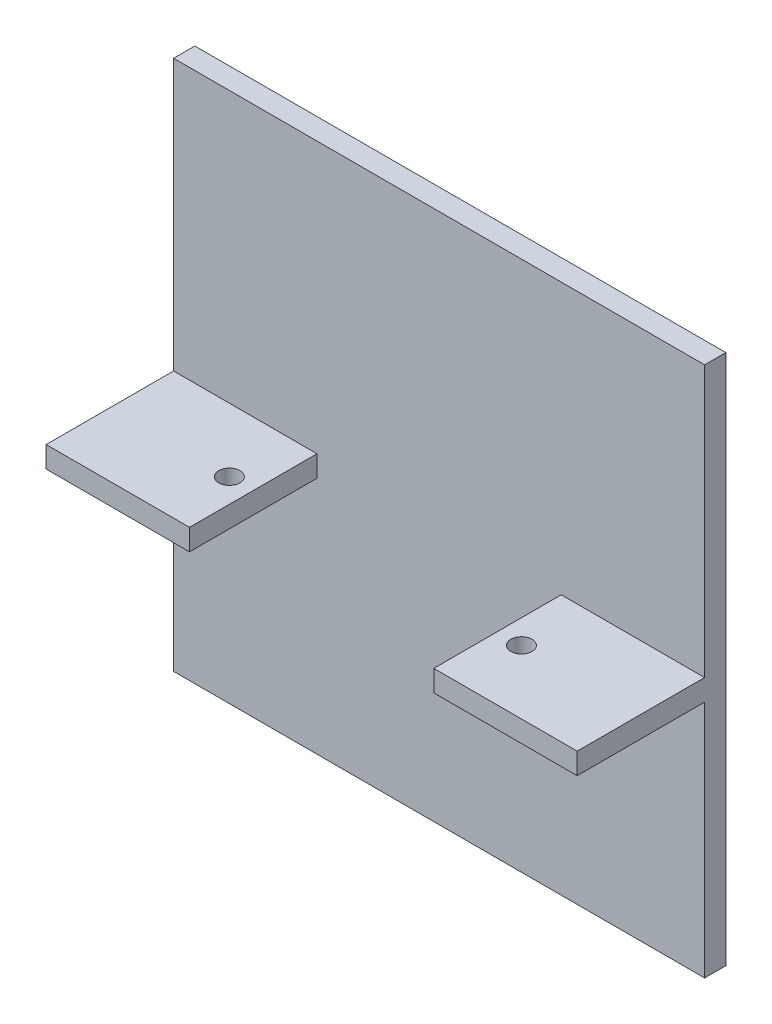
ISO-10303-21;
HEADER;
FILE_DESCRIPTION(('STEP AP214'),'2;1');
FILE_NAME('part.step','',(''),(''),'','','');
FILE_SCHEMA(('AUTOMOTIVE_DESIGN { 1 0 10303 214 1 1 1 1 }'));
ENDSEC;
DATA;
#1=APPLICATION_CONTEXT('core data for automotive mechanical design processes');
#2=APPLICATION_PROTOCOL_DEFINITION('international standard','automotive_design',2000,#1);
#3=PRODUCT_CONTEXT('',#1,'mechanical');
#4=PRODUCT('Part','Part','',(#3));
#5=PRODUCT_RELATED_PRODUCT_CATEGORY('part','',(#4));
#6=PRODUCT_DEFINITION_FORMATION('','',#4);
#7=PRODUCT_DEFINITION_CONTEXT('part definition',#1,'design');
#8=PRODUCT_DEFINITION('design','',#6,#7);
#9=PRODUCT_DEFINITION_SHAPE('','',#8);
#10=(LENGTH_UNIT() NAMED_UNIT(*) SI_UNIT(.MILLI.,.METRE.));
#11=(NAMED_UNIT(*) PLANE_ANGLE_UNIT() SI_UNIT($,.RADIAN.));
#12=(NAMED_UNIT(*) SI_UNIT($,.STERADIAN.) SOLID_ANGLE_UNIT());
#13=UNCERTAINTY_MEASURE_WITH_UNIT(LENGTH_MEASURE(1.E-05),#10,'distance_accuracy_value','');
#14=(GEOMETRIC_REPRESENTATION_CONTEXT(3) GLOBAL_UNCERTAINTY_ASSIGNED_CONTEXT((#13)) GLOBAL_UNIT_ASSIGNED_CONTEXT((#10,
#11,#12)) REPRESENTATION_CONTEXT('',''));
#15=CARTESIAN_POINT('',(0.,0.,0.));
#16=DIRECTION('',(0.,0.,1.));
#17=DIRECTION('',(1.,0.,0.));
#18=AXIS2_PLACEMENT_3D('',#15,#16,#17);
#19=CARTESIAN_POINT('',(25.,25.,2.));
#20=DIRECTION('',(-1.,0.,0.));
#21=DIRECTION('',(0.,-1.,0.));
#22=AXIS2_PLACEMENT_3D('',#19,#20,#21);
#23=PLANE('',#22);
#24=DIRECTION('',(0.,1.,0.));
#25=VECTOR('',#24,1.);
#26=CARTESIAN_POINT('',(25.,25.,0.));
#27=LINE('',#26,#25);
#28=CARTESIAN_POINT('',(25.,-25.,0.));
#29=VERTEX_POINT('',#28);
#30=CARTESIAN_POINT('',(25.,25.,0.));
#31=VERTEX_POINT('',#30);
#32=EDGE_CURVE('E196',#29,#31,#27,.T.);
#33=ORIENTED_EDGE('',*,*,#32,.T.);
#34=DIRECTION('',(0.,0.,-1.));
#35=VECTOR('',#34,1.);
#36=CARTESIAN_POINT('',(25.,25.,2.));
#37=LINE('',#36,#35);
#38=CARTESIAN_POINT('',(25.,25.,2.));
#39=VERTEX_POINT('',#38);
#40=EDGE_CURVE('E11',#39,#31,#37,.T.);
#41=ORIENTED_EDGE('',*,*,#40,.F.);
#42=DIRECTION('',(0.,1.,0.));
#43=VECTOR('',#42,1.);
#44=CARTESIAN_POINT('',(25.,25.,2.));
#45=LINE('',#44,#43);
#46=CARTESIAN_POINT('',(25.,-0.499999999999995,2.));
#47=VERTEX_POINT('',#46);
#48=EDGE_CURVE('E147',#47,#39,#45,.T.);
#49=ORIENTED_EDGE('',*,*,#48,.F.);
#50=DIRECTION('',(0.,0.,-1.));
#51=VECTOR('',#50,1.);
#52=CARTESIAN_POINT('',(25.,-0.499999999999995,2.));
#53=LINE('',#52,#51);
#54=CARTESIAN_POINT('',(25.,-0.499999999999995,14.));
#55=VERTEX_POINT('',#54);
#56=EDGE_CURVE('E128',#55,#47,#53,.T.);
#57=ORIENTED_EDGE('',*,*,#56,.F.);
#58=DIRECTION('',(0.,-1.,0.));
#59=VECTOR('',#58,1.);
#60=CARTESIAN_POINT('',(25.,-0.499999999999995,14.));
#61=LINE('',#60,#59);
#62=CARTESIAN_POINT('',(25.,-2.5,14.));
#63=VERTEX_POINT('',#62);
#64=EDGE_CURVE('E134',#55,#63,#61,.T.);
#65=ORIENTED_EDGE('',*,*,#64,.T.);
#66=DIRECTION('',(0.,0.,-1.));
#67=VECTOR('',#66,1.);
#68=CARTESIAN_POINT('',(25.,-2.5,2.));
#69=LINE('',#68,#67);
#70=CARTESIAN_POINT('',(25.,-2.5,2.));
#71=VERTEX_POINT('',#70);
#72=EDGE_CURVE('E159',#63,#71,#69,.T.);
#73=ORIENTED_EDGE('',*,*,#72,.T.);
#74=CARTESIAN_POINT('',(25.,-25.,2.));
#75=VERTEX_POINT('',#74);
#76=EDGE_CURVE('E201',#75,#71,#45,.T.);
#77=ORIENTED_EDGE('',*,*,#76,.F.);
#78=DIRECTION('',(0.,0.,-1.));
#79=VECTOR('',#78,1.);
#80=CARTESIAN_POINT('',(25.,-25.,2.));
#81=LINE('',#80,#79);
#82=EDGE_CURVE('E212',#75,#29,#81,.T.);
#83=ORIENTED_EDGE('',*,*,#82,.T.);
#84=EDGE_LOOP('',(#33,#41,#49,#57,#65,#73,#77,#83));
#85=FACE_BOUND('',#84,.T.);
#86=ADVANCED_FACE('F35',(#85),#23,.F.);
#87=CARTESIAN_POINT('',(-25.,25.,2.));
#88=DIRECTION('',(0.,-1.,0.));
#89=DIRECTION('',(0.,0.,-1.));
#90=AXIS2_PLACEMENT_3D('',#87,#88,#89);
#91=PLANE('',#90);
#92=DIRECTION('',(-1.,0.,0.));
#93=VECTOR('',#92,1.);
#94=CARTESIAN_POINT('',(-25.,25.,0.));
#95=LINE('',#94,#93);
#96=CARTESIAN_POINT('',(-25.,25.,0.));
#97=VERTEX_POINT('',#96);
#98=EDGE_CURVE('E214',#31,#97,#95,.T.);
#99=ORIENTED_EDGE('',*,*,#98,.T.);
#100=DIRECTION('',(0.,0.,-1.));
#101=VECTOR('',#100,1.);
#102=CARTESIAN_POINT('',(-25.,25.,2.));
#103=LINE('',#102,#101);
#104=CARTESIAN_POINT('',(-25.,25.,2.));
#105=VERTEX_POINT('',#104);
#106=EDGE_CURVE('E42',#105,#97,#103,.T.);
#107=ORIENTED_EDGE('',*,*,#106,.F.);
#108=DIRECTION('',(-1.,0.,0.));
#109=VECTOR('',#108,1.);
#110=CARTESIAN_POINT('',(-25.,25.,2.));
#111=LINE('',#110,#109);
#112=EDGE_CURVE('E204',#39,#105,#111,.T.);
#113=ORIENTED_EDGE('',*,*,#112,.F.);
#114=ORIENTED_EDGE('',*,*,#40,.T.);
#115=EDGE_LOOP('',(#99,#107,#113,#114));
#116=FACE_BOUND('',#115,.T.);
#117=ADVANCED_FACE('F256',(#116),#91,.F.);
#118=CARTESIAN_POINT('',(-25.,25.,2.));
#119=DIRECTION('',(1.,0.,0.));
#120=DIRECTION('',(0.,1.,0.));
#121=AXIS2_PLACEMENT_3D('',#118,#119,#120);
#122=PLANE('',#121);
#123=DIRECTION('',(0.,-1.,0.));
#124=VECTOR('',#123,1.);
#125=CARTESIAN_POINT('',(-25.,25.,0.));
#126=LINE('',#125,#124);
#127=CARTESIAN_POINT('',(-25.,-25.,0.));
#128=VERTEX_POINT('',#127);
#129=EDGE_CURVE('E216',#97,#128,#126,.T.);
#130=ORIENTED_EDGE('',*,*,#129,.T.);
#131=DIRECTION('',(0.,0.,-1.));
#132=VECTOR('',#131,1.);
#133=CARTESIAN_POINT('',(-25.,-25.,2.));
#134=LINE('',#133,#132);
#135=CARTESIAN_POINT('',(-25.,-25.,2.));
#136=VERTEX_POINT('',#135);
#137=EDGE_CURVE('E222',#136,#128,#134,.T.);
#138=ORIENTED_EDGE('',*,*,#137,.F.);
#139=DIRECTION('',(0.,-1.,0.));
#140=VECTOR('',#139,1.);
#141=CARTESIAN_POINT('',(-25.,25.,2.));
#142=LINE('',#141,#140);
#143=CARTESIAN_POINT('',(-25.,-2.5,2.));
#144=VERTEX_POINT('',#143);
#145=EDGE_CURVE('E206',#144,#136,#142,.T.);
#146=ORIENTED_EDGE('',*,*,#145,.F.);
#147=DIRECTION('',(0.,0.,-1.));
#148=VECTOR('',#147,1.);
#149=CARTESIAN_POINT('',(-25.,-2.5,2.));
#150=LINE('',#149,#148);
#151=CARTESIAN_POINT('',(-25.,-2.5,14.));
#152=VERTEX_POINT('',#151);
#153=EDGE_CURVE('E171',#152,#144,#150,.T.);
#154=ORIENTED_EDGE('',*,*,#153,.F.);
#155=DIRECTION('',(0.,-1.,0.));
#156=VECTOR('',#155,1.);
#157=CARTESIAN_POINT('',(-25.,-0.499999999999995,14.));
#158=LINE('',#157,#156);
#159=CARTESIAN_POINT('',(-25.,-0.499999999999995,14.));
#160=VERTEX_POINT('',#159);
#161=EDGE_CURVE('E194',#160,#152,#158,.T.);
#162=ORIENTED_EDGE('',*,*,#161,.F.);
#163=DIRECTION('',(0.,0.,-1.));
#164=VECTOR('',#163,1.);
#165=CARTESIAN_POINT('',(-25.,-0.499999999999995,2.));
#166=LINE('',#165,#164);
#167=CARTESIAN_POINT('',(-25.,-0.499999999999995,2.));
#168=VERTEX_POINT('',#167);
#169=EDGE_CURVE('E174',#160,#168,#166,.T.);
#170=ORIENTED_EDGE('',*,*,#169,.T.);
#171=EDGE_CURVE('E207',#105,#168,#142,.T.);
#172=ORIENTED_EDGE('',*,*,#171,.F.);
#173=ORIENTED_EDGE('',*,*,#106,.T.);
#174=EDGE_LOOP('',(#130,#138,#146,#154,#162,#170,#172,#173));
#175=FACE_BOUND('',#174,.T.);
#176=ADVANCED_FACE('F229',(#175),#122,.F.);
#177=CARTESIAN_POINT('',(-25.,-25.,2.));
#178=DIRECTION('',(0.,1.,0.));
#179=DIRECTION('',(0.,0.,1.));
#180=AXIS2_PLACEMENT_3D('',#177,#178,#179);
#181=PLANE('',#180);
#182=DIRECTION('',(1.,0.,0.));
#183=VECTOR('',#182,1.);
#184=CARTESIAN_POINT('',(-25.,-25.,0.));
#185=LINE('',#184,#183);
#186=EDGE_CURVE('E218',#128,#29,#185,.T.);
#187=ORIENTED_EDGE('',*,*,#186,.T.);
#188=ORIENTED_EDGE('',*,*,#82,.F.);
#189=DIRECTION('',(1.,0.,0.));
#190=VECTOR('',#189,1.);
#191=CARTESIAN_POINT('',(-25.,-25.,2.));
#192=LINE('',#191,#190);
#193=EDGE_CURVE('E210',#136,#75,#192,.T.);
#194=ORIENTED_EDGE('',*,*,#193,.F.);
#195=ORIENTED_EDGE('',*,*,#137,.T.);
#196=EDGE_LOOP('',(#187,#188,#194,#195));
#197=FACE_BOUND('',#196,.T.);
#198=ADVANCED_FACE('F239',(#197),#181,.F.);
#199=CARTESIAN_POINT('',(0.,0.,2.));
#200=DIRECTION('',(0.,0.,1.));
#201=DIRECTION('',(1.,0.,0.));
#202=AXIS2_PLACEMENT_3D('',#199,#200,#201);
#203=PLANE('',#202);
#204=DIRECTION('',(-1.,0.,0.));
#205=VECTOR('',#204,1.);
#206=CARTESIAN_POINT('',(25.,-0.499999999999995,2.));
#207=LINE('',#206,#205);
#208=CARTESIAN_POINT('',(11.5,-0.499999999999995,2.));
#209=VERTEX_POINT('',#208);
#210=EDGE_CURVE('E142',#47,#209,#207,.T.);
#211=ORIENTED_EDGE('',*,*,#210,.F.);
#212=ORIENTED_EDGE('',*,*,#48,.T.);
#213=ORIENTED_EDGE('',*,*,#112,.T.);
#214=ORIENTED_EDGE('',*,*,#171,.T.);
#215=DIRECTION('',(1.,0.,0.));
#216=VECTOR('',#215,1.);
#217=CARTESIAN_POINT('',(-25.,-0.499999999999995,2.));
#218=LINE('',#217,#216);
#219=CARTESIAN_POINT('',(-11.5,-0.499999999999995,2.));
#220=VERTEX_POINT('',#219);
#221=EDGE_CURVE('E177',#168,#220,#218,.T.);
#222=ORIENTED_EDGE('',*,*,#221,.T.);
#223=DIRECTION('',(0.,-1.,0.));
#224=VECTOR('',#223,1.);
#225=CARTESIAN_POINT('',(-11.5,-0.499999999999995,2.));
#226=LINE('',#225,#224);
#227=CARTESIAN_POINT('',(-11.5,-2.5,2.));
#228=VERTEX_POINT('',#227);
#229=EDGE_CURVE('E187',#220,#228,#226,.T.);
#230=ORIENTED_EDGE('',*,*,#229,.T.);
#231=DIRECTION('',(1.,0.,0.));
#232=VECTOR('',#231,1.);
#233=CARTESIAN_POINT('',(-25.,-2.5,2.));
#234=LINE('',#233,#232);
#235=EDGE_CURVE('E57',#144,#228,#234,.T.);
#236=ORIENTED_EDGE('',*,*,#235,.F.);
#237=ORIENTED_EDGE('',*,*,#145,.T.);
#238=ORIENTED_EDGE('',*,*,#193,.T.);
#239=ORIENTED_EDGE('',*,*,#76,.T.);
#240=DIRECTION('',(-1.,0.,0.));
#241=VECTOR('',#240,1.);
#242=CARTESIAN_POINT('',(25.,-2.5,2.));
#243=LINE('',#242,#241);
#244=CARTESIAN_POINT('',(11.5,-2.5,2.));
#245=VERTEX_POINT('',#244);
#246=EDGE_CURVE('E148',#71,#245,#243,.T.);
#247=ORIENTED_EDGE('',*,*,#246,.T.);
#248=DIRECTION('',(0.,-1.,0.));
#249=VECTOR('',#248,1.);
#250=CARTESIAN_POINT('',(11.5,-0.499999999999995,2.));
#251=LINE('',#250,#249);
#252=EDGE_CURVE('E164',#209,#245,#251,.T.);
#253=ORIENTED_EDGE('',*,*,#252,.F.);
#254=EDGE_LOOP('',(#211,#212,#213,#214,#222,#230,#236,#237,#238,#239,#247,#253));
#255=FACE_BOUND('',#254,.T.);
#256=ADVANCED_FACE('F243',(#255),#203,.T.);
#257=CARTESIAN_POINT('',(0.,0.,0.));
#258=DIRECTION('',(0.,0.,1.));
#259=DIRECTION('',(1.,0.,0.));
#260=AXIS2_PLACEMENT_3D('',#257,#258,#259);
#261=PLANE('',#260);
#262=ORIENTED_EDGE('',*,*,#32,.F.);
#263=ORIENTED_EDGE('',*,*,#186,.F.);
#264=ORIENTED_EDGE('',*,*,#129,.F.);
#265=ORIENTED_EDGE('',*,*,#98,.F.);
#266=EDGE_LOOP('',(#262,#263,#264,#265));
#267=FACE_BOUND('',#266,.T.);
#268=ADVANCED_FACE('F236',(#267),#261,.F.);
#269=CARTESIAN_POINT('',(-25.,-0.499999999999995,14.));
#270=DIRECTION('',(0.,0.,1.));
#271=DIRECTION('',(1.,0.,0.));
#272=AXIS2_PLACEMENT_3D('',#269,#270,#271);
#273=PLANE('',#272);
#274=DIRECTION('',(-1.,0.,0.));
#275=VECTOR('',#274,1.);
#276=CARTESIAN_POINT('',(-25.,-2.5,14.));
#277=LINE('',#276,#275);
#278=CARTESIAN_POINT('',(-11.5,-2.5,14.));
#279=VERTEX_POINT('',#278);
#280=EDGE_CURVE('E178',#279,#152,#277,.T.);
#281=ORIENTED_EDGE('',*,*,#280,.F.);
#282=DIRECTION('',(0.,-1.,0.));
#283=VECTOR('',#282,1.);
#284=CARTESIAN_POINT('',(-11.5,-0.499999999999995,14.));
#285=LINE('',#284,#283);
#286=CARTESIAN_POINT('',(-11.5,-0.499999999999995,14.));
#287=VERTEX_POINT('',#286);
#288=EDGE_CURVE('E197',#287,#279,#285,.T.);
#289=ORIENTED_EDGE('',*,*,#288,.F.);
#290=DIRECTION('',(-1.,0.,0.));
#291=VECTOR('',#290,1.);
#292=CARTESIAN_POINT('',(-25.,-0.499999999999995,14.));
#293=LINE('',#292,#291);
#294=EDGE_CURVE('E184',#287,#160,#293,.T.);
#295=ORIENTED_EDGE('',*,*,#294,.T.);
#296=ORIENTED_EDGE('',*,*,#161,.T.);
#297=EDGE_LOOP('',(#281,#289,#295,#296));
#298=FACE_BOUND('',#297,.T.);
#299=ADVANCED_FACE('F251',(#298),#273,.T.);
#300=CARTESIAN_POINT('',(-11.5,-0.499999999999995,2.));
#301=DIRECTION('',(1.,0.,0.));
#302=DIRECTION('',(0.,0.,-1.));
#303=AXIS2_PLACEMENT_3D('',#300,#301,#302);
#304=PLANE('',#303);
#305=DIRECTION('',(0.,0.,1.));
#306=VECTOR('',#305,1.);
#307=CARTESIAN_POINT('',(-11.5,-2.5,2.));
#308=LINE('',#307,#306);
#309=EDGE_CURVE('E190',#228,#279,#308,.T.);
#310=ORIENTED_EDGE('',*,*,#309,.F.);
#311=ORIENTED_EDGE('',*,*,#229,.F.);
#312=DIRECTION('',(0.,0.,1.));
#313=VECTOR('',#312,1.);
#314=CARTESIAN_POINT('',(-11.5,-0.499999999999995,2.));
#315=LINE('',#314,#313);
#316=EDGE_CURVE('E181',#220,#287,#315,.T.);
#317=ORIENTED_EDGE('',*,*,#316,.T.);
#318=ORIENTED_EDGE('',*,*,#288,.T.);
#319=EDGE_LOOP('',(#310,#311,#317,#318));
#320=FACE_BOUND('',#319,.T.);
#321=ADVANCED_FACE('F270',(#320),#304,.T.);
#322=CARTESIAN_POINT('',(0.,-0.499999999999995,0.));
#323=DIRECTION('',(0.,1.,0.));
#324=DIRECTION('',(0.,0.,1.));
#325=AXIS2_PLACEMENT_3D('',#322,#323,#324);
#326=PLANE('',#325);
#327=CARTESIAN_POINT('',(-13.75,-0.499999999999995,8.));
#328=DIRECTION('',(0.,-1.,0.));
#329=DIRECTION('',(0.,0.,-1.));
#330=AXIS2_PLACEMENT_3D('',#327,#328,#329);
#331=CIRCLE('',#330,1.);
#332=CARTESIAN_POINT('',(-13.75,-0.499999999999995,7.));
#333=VERTEX_POINT('',#332);
#334=EDGE_CURVE('E168',#333,#333,#331,.T.);
#335=ORIENTED_EDGE('',*,*,#334,.T.);
#336=EDGE_LOOP('',(#335));
#337=FACE_BOUND('',#336,.T.);
#338=ORIENTED_EDGE('',*,*,#169,.F.);
#339=ORIENTED_EDGE('',*,*,#294,.F.);
#340=ORIENTED_EDGE('',*,*,#316,.F.);
#341=ORIENTED_EDGE('',*,*,#221,.F.);
#342=EDGE_LOOP('',(#338,#339,#340,#341));
#343=FACE_BOUND('',#342,.T.);
#344=ADVANCED_FACE('F255',(#337,#343),#326,.T.);
#345=CARTESIAN_POINT('',(0.,-2.5,0.));
#346=DIRECTION('',(0.,1.,0.));
#347=DIRECTION('',(0.,0.,1.));
#348=AXIS2_PLACEMENT_3D('',#345,#346,#347);
#349=PLANE('',#348);
#350=CARTESIAN_POINT('',(-13.75,-2.5,8.));
#351=DIRECTION('',(0.,-1.,0.));
#352=DIRECTION('',(0.,0.,-1.));
#353=AXIS2_PLACEMENT_3D('',#350,#351,#352);
#354=CIRCLE('',#353,1.);
#355=CARTESIAN_POINT('',(-13.75,-2.5,7.));
#356=VERTEX_POINT('',#355);
#357=EDGE_CURVE('E166',#356,#356,#354,.T.);
#358=ORIENTED_EDGE('',*,*,#357,.F.);
#359=EDGE_LOOP('',(#358));
#360=FACE_BOUND('',#359,.T.);
#361=ORIENTED_EDGE('',*,*,#153,.T.);
#362=ORIENTED_EDGE('',*,*,#235,.T.);
#363=ORIENTED_EDGE('',*,*,#309,.T.);
#364=ORIENTED_EDGE('',*,*,#280,.T.);
#365=EDGE_LOOP('',(#361,#362,#363,#364));
#366=FACE_BOUND('',#365,.T.);
#367=ADVANCED_FACE('F249',(#360,#366),#349,.F.);
#368=CARTESIAN_POINT('',(-13.75,-0.499999999999995,8.));
#369=DIRECTION('',(0.,-1.,0.));
#370=DIRECTION('',(0.,0.,-1.));
#371=AXIS2_PLACEMENT_3D('',#368,#369,#370);
#372=CYLINDRICAL_SURFACE('',#371,1.);
#373=ORIENTED_EDGE('',*,*,#334,.F.);
#374=EDGE_LOOP('',(#373));
#375=FACE_BOUND('',#374,.T.);
#376=ORIENTED_EDGE('',*,*,#357,.T.);
#377=EDGE_LOOP('',(#376));
#378=FACE_BOUND('',#377,.T.);
#379=ADVANCED_FACE('F278',(#375,#378),#372,.F.);
#380=CARTESIAN_POINT('',(0.,-0.499999999999995,0.));
#381=DIRECTION('',(0.,1.,0.));
#382=DIRECTION('',(0.,0.,1.));
#383=AXIS2_PLACEMENT_3D('',#380,#381,#382);
#384=PLANE('',#383);
#385=ORIENTED_EDGE('',*,*,#56,.T.);
#386=ORIENTED_EDGE('',*,*,#210,.T.);
#387=DIRECTION('',(0.,0.,1.));
#388=VECTOR('',#387,1.);
#389=CARTESIAN_POINT('',(11.5,-0.499999999999995,2.));
#390=LINE('',#389,#388);
#391=CARTESIAN_POINT('',(11.5,-0.499999999999995,14.));
#392=VERTEX_POINT('',#391);
#393=EDGE_CURVE('E49',#209,#392,#390,.T.);
#394=ORIENTED_EDGE('',*,*,#393,.T.);
#395=DIRECTION('',(1.,0.,0.));
#396=VECTOR('',#395,1.);
#397=CARTESIAN_POINT('',(25.,-0.499999999999995,14.));
#398=LINE('',#397,#396);
#399=EDGE_CURVE('E123',#392,#55,#398,.T.);
#400=ORIENTED_EDGE('',*,*,#399,.T.);
#401=EDGE_LOOP('',(#385,#386,#394,#400));
#402=FACE_BOUND('',#401,.T.);
#403=CARTESIAN_POINT('',(13.75,-0.499999999999995,8.));
#404=DIRECTION('',(0.,1.,0.));
#405=DIRECTION('',(0.,0.,-1.));
#406=AXIS2_PLACEMENT_3D('',#403,#404,#405);
#407=CIRCLE('',#406,1.);
#408=CARTESIAN_POINT('',(13.75,-0.499999999999995,7.));
#409=VERTEX_POINT('',#408);
#410=EDGE_CURVE('E161',#409,#409,#407,.T.);
#411=ORIENTED_EDGE('',*,*,#410,.F.);
#412=EDGE_LOOP('',(#411));
#413=FACE_BOUND('',#412,.T.);
#414=ADVANCED_FACE('F125',(#402,#413),#384,.T.);
#415=CARTESIAN_POINT('',(0.,-2.5,0.));
#416=DIRECTION('',(0.,1.,0.));
#417=DIRECTION('',(0.,0.,1.));
#418=AXIS2_PLACEMENT_3D('',#415,#416,#417);
#419=PLANE('',#418);
#420=ORIENTED_EDGE('',*,*,#72,.F.);
#421=DIRECTION('',(1.,0.,0.));
#422=VECTOR('',#421,1.);
#423=CARTESIAN_POINT('',(25.,-2.5,14.));
#424=LINE('',#423,#422);
#425=CARTESIAN_POINT('',(11.5,-2.5,14.));
#426=VERTEX_POINT('',#425);
#427=EDGE_CURVE('E137',#426,#63,#424,.T.);
#428=ORIENTED_EDGE('',*,*,#427,.F.);
#429=DIRECTION('',(0.,0.,1.));
#430=VECTOR('',#429,1.);
#431=CARTESIAN_POINT('',(11.5,-2.5,2.));
#432=LINE('',#431,#430);
#433=EDGE_CURVE('E151',#245,#426,#432,.T.);
#434=ORIENTED_EDGE('',*,*,#433,.F.);
#435=ORIENTED_EDGE('',*,*,#246,.F.);
#436=EDGE_LOOP('',(#420,#428,#434,#435));
#437=FACE_BOUND('',#436,.T.);
#438=CARTESIAN_POINT('',(13.75,-2.5,8.));
#439=DIRECTION('',(0.,1.,0.));
#440=DIRECTION('',(0.,0.,-1.));
#441=AXIS2_PLACEMENT_3D('',#438,#439,#440);
#442=CIRCLE('',#441,1.);
#443=CARTESIAN_POINT('',(13.75,-2.5,7.));
#444=VERTEX_POINT('',#443);
#445=EDGE_CURVE('E154',#444,#444,#442,.T.);
#446=ORIENTED_EDGE('',*,*,#445,.T.);
#447=EDGE_LOOP('',(#446));
#448=FACE_BOUND('',#447,.T.);
#449=ADVANCED_FACE('F292',(#437,#448),#419,.F.);
#450=CARTESIAN_POINT('',(11.5,-0.499999999999995,2.));
#451=DIRECTION('',(1.,0.,0.));
#452=DIRECTION('',(0.,0.,-1.));
#453=AXIS2_PLACEMENT_3D('',#450,#451,#452);
#454=PLANE('',#453);
#455=ORIENTED_EDGE('',*,*,#433,.T.);
#456=DIRECTION('',(0.,-1.,0.));
#457=VECTOR('',#456,1.);
#458=CARTESIAN_POINT('',(11.5,-0.499999999999995,14.));
#459=LINE('',#458,#457);
#460=EDGE_CURVE('E141',#392,#426,#459,.T.);
#461=ORIENTED_EDGE('',*,*,#460,.F.);
#462=ORIENTED_EDGE('',*,*,#393,.F.);
#463=ORIENTED_EDGE('',*,*,#252,.T.);
#464=EDGE_LOOP('',(#455,#461,#462,#463));
#465=FACE_BOUND('',#464,.T.);
#466=ADVANCED_FACE('F289',(#465),#454,.F.);
#467=CARTESIAN_POINT('',(25.,-0.499999999999995,14.));
#468=DIRECTION('',(0.,0.,-1.));
#469=DIRECTION('',(-1.,0.,0.));
#470=AXIS2_PLACEMENT_3D('',#467,#468,#469);
#471=PLANE('',#470);
#472=ORIENTED_EDGE('',*,*,#427,.T.);
#473=ORIENTED_EDGE('',*,*,#64,.F.);
#474=ORIENTED_EDGE('',*,*,#399,.F.);
#475=ORIENTED_EDGE('',*,*,#460,.T.);
#476=EDGE_LOOP('',(#472,#473,#474,#475));
#477=FACE_BOUND('',#476,.T.);
#478=ADVANCED_FACE('F135',(#477),#471,.F.);
#479=CARTESIAN_POINT('',(13.75,-0.499999999999995,8.));
#480=DIRECTION('',(0.,-1.,0.));
#481=DIRECTION('',(0.,0.,-1.));
#482=AXIS2_PLACEMENT_3D('',#479,#480,#481);
#483=CYLINDRICAL_SURFACE('',#482,1.);
#484=ORIENTED_EDGE('',*,*,#410,.T.);
#485=EDGE_LOOP('',(#484));
#486=FACE_BOUND('',#485,.T.);
#487=ORIENTED_EDGE('',*,*,#445,.F.);
#488=EDGE_LOOP('',(#487));
#489=FACE_BOUND('',#488,.T.);
#490=ADVANCED_FACE('F288',(#486,#489),#483,.F.);
#491=CLOSED_SHELL('',(#86,#117,#176,#198,#256,#268,#299,#321,#344,#367,#379,#414,#449,#466,#478,#490));
#492=MANIFOLD_SOLID_BREP('B2',#491);
#493=ADVANCED_BREP_SHAPE_REPRESENTATION('',(#18,#492),#14);
#494=SHAPE_DEFINITION_REPRESENTATION(#9,#493);
ENDSEC;
END-ISO-10303-21;
